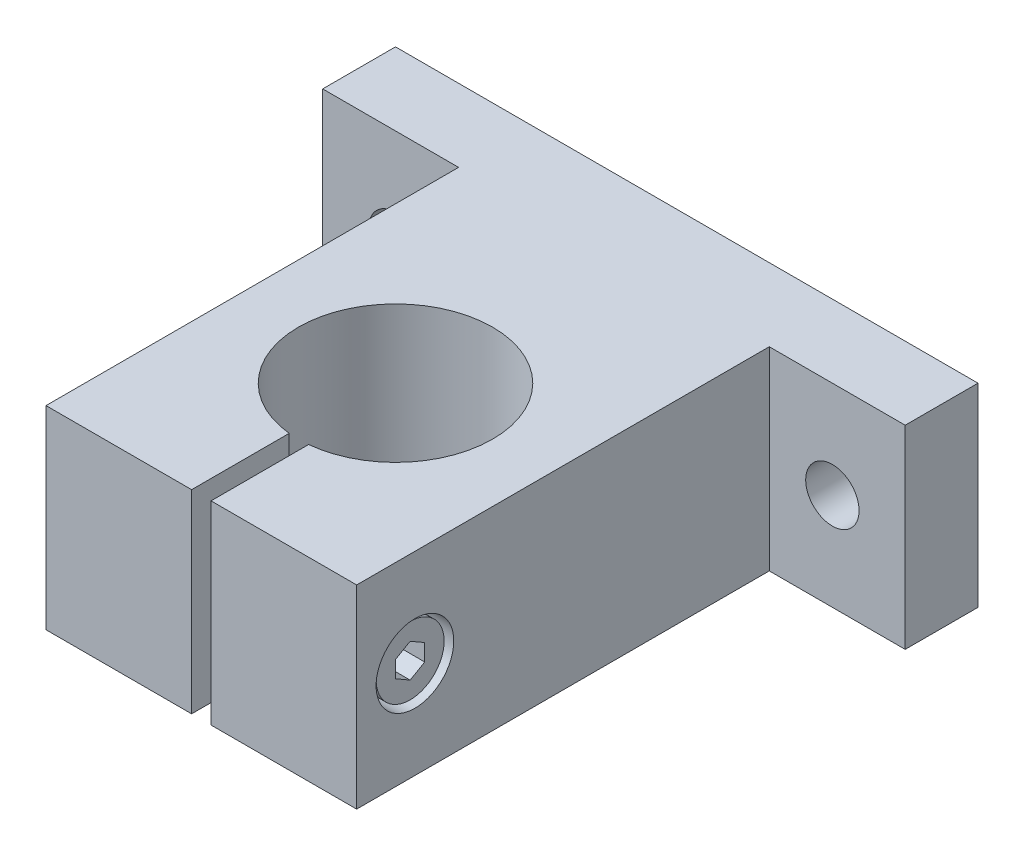
ISO-10303-21;
HEADER;
FILE_DESCRIPTION(('STEP AP214'),'2;1');
FILE_NAME('part.step','',(''),(''),'','','');
FILE_SCHEMA(('AUTOMOTIVE_DESIGN { 1 0 10303 214 1 1 1 1 }'));
ENDSEC;
DATA;
#1=APPLICATION_CONTEXT('core data for automotive mechanical design processes');
#2=APPLICATION_PROTOCOL_DEFINITION('international standard','automotive_design',2000,#1);
#3=PRODUCT_CONTEXT('',#1,'mechanical');
#4=PRODUCT('Part','Part','',(#3));
#5=PRODUCT_RELATED_PRODUCT_CATEGORY('part','',(#4));
#6=PRODUCT_DEFINITION_FORMATION('','',#4);
#7=PRODUCT_DEFINITION_CONTEXT('part definition',#1,'design');
#8=PRODUCT_DEFINITION('design','',#6,#7);
#9=PRODUCT_DEFINITION_SHAPE('','',#8);
#10=(LENGTH_UNIT() NAMED_UNIT(*) SI_UNIT(.MILLI.,.METRE.));
#11=(NAMED_UNIT(*) PLANE_ANGLE_UNIT() SI_UNIT($,.RADIAN.));
#12=(NAMED_UNIT(*) SI_UNIT($,.STERADIAN.) SOLID_ANGLE_UNIT());
#13=UNCERTAINTY_MEASURE_WITH_UNIT(LENGTH_MEASURE(1.E-05),#10,'distance_accuracy_value','');
#14=(GEOMETRIC_REPRESENTATION_CONTEXT(3) GLOBAL_UNCERTAINTY_ASSIGNED_CONTEXT((#13)) GLOBAL_UNIT_ASSIGNED_CONTEXT((#10,
#11,#12)) REPRESENTATION_CONTEXT('',''));
#15=CARTESIAN_POINT('',(0.,0.,0.));
#16=DIRECTION('',(0.,0.,1.));
#17=DIRECTION('',(1.,0.,0.));
#18=AXIS2_PLACEMENT_3D('',#15,#16,#17);
#19=CARTESIAN_POINT('',(15.51,-1.73205080756888,14.));
#20=DIRECTION('',(0.,-0.866025403784439,-0.5));
#21=DIRECTION('',(0.,0.5,-0.866025403784439));
#22=AXIS2_PLACEMENT_3D('',#19,#20,#21);
#23=PLANE('',#22);
#24=DIRECTION('',(1.,0.,0.));
#25=VECTOR('',#24,1.);
#26=CARTESIAN_POINT('',(15.51,-1.73205080756888,14.));
#27=LINE('',#26,#25);
#28=CARTESIAN_POINT('',(12.8433333333333,-1.73205080756888,14.));
#29=VERTEX_POINT('',#28);
#30=CARTESIAN_POINT('',(15.51,-1.73205080756888,14.));
#31=VERTEX_POINT('',#30);
#32=EDGE_CURVE('E422',#29,#31,#27,.T.);
#33=ORIENTED_EDGE('',*,*,#32,.T.);
#34=DIRECTION('',(0.,0.5,-0.866025403784439));
#35=VECTOR('',#34,1.);
#36=CARTESIAN_POINT('',(15.51,-1.73205080756888,14.));
#37=LINE('',#36,#35);
#38=CARTESIAN_POINT('',(15.51,-0.86602540378444,12.5));
#39=VERTEX_POINT('',#38);
#40=EDGE_CURVE('E429',#39,#31,#37,.F.);
#41=ORIENTED_EDGE('',*,*,#40,.F.);
#42=DIRECTION('',(-1.,0.,0.));
#43=VECTOR('',#42,1.);
#44=CARTESIAN_POINT('',(15.51,-0.86602540378444,12.5));
#45=LINE('',#44,#43);
#46=CARTESIAN_POINT('',(12.8433333333333,-0.866025403784439,12.5));
#47=VERTEX_POINT('',#46);
#48=EDGE_CURVE('E408',#39,#47,#45,.T.);
#49=ORIENTED_EDGE('',*,*,#48,.T.);
#50=DIRECTION('',(0.,0.5,-0.866025403784439));
#51=VECTOR('',#50,1.);
#52=CARTESIAN_POINT('',(12.8433333333333,-1.73205080756888,14.));
#53=LINE('',#52,#51);
#54=EDGE_CURVE('E426',#29,#47,#53,.T.);
#55=ORIENTED_EDGE('',*,*,#54,.F.);
#56=EDGE_LOOP('',(#33,#41,#49,#55));
#57=FACE_BOUND('',#56,.T.);
#58=ADVANCED_FACE('F16',(#57),#23,.F.);
#59=CARTESIAN_POINT('',(15.51,-0.86602540378444,15.5));
#60=DIRECTION('',(0.,-0.866025403784439,0.5));
#61=DIRECTION('',(0.,-0.5,-0.866025403784439));
#62=AXIS2_PLACEMENT_3D('',#59,#60,#61);
#63=PLANE('',#62);
#64=DIRECTION('',(1.,0.,0.));
#65=VECTOR('',#64,1.);
#66=CARTESIAN_POINT('',(15.51,-0.866025403784439,15.5));
#67=LINE('',#66,#65);
#68=CARTESIAN_POINT('',(12.8433333333333,-0.866025403784439,15.5));
#69=VERTEX_POINT('',#68);
#70=CARTESIAN_POINT('',(15.51,-0.86602540378444,15.5));
#71=VERTEX_POINT('',#70);
#72=EDGE_CURVE('E401',#69,#71,#67,.T.);
#73=ORIENTED_EDGE('',*,*,#72,.T.);
#74=DIRECTION('',(0.,-0.5,-0.866025403784439));
#75=VECTOR('',#74,1.);
#76=CARTESIAN_POINT('',(15.51,-0.86602540378444,15.5));
#77=LINE('',#76,#75);
#78=EDGE_CURVE('E419',#31,#71,#77,.F.);
#79=ORIENTED_EDGE('',*,*,#78,.F.);
#80=ORIENTED_EDGE('',*,*,#32,.F.);
#81=DIRECTION('',(0.,-0.5,-0.866025403784439));
#82=VECTOR('',#81,1.);
#83=CARTESIAN_POINT('',(12.8433333333333,-0.866025403784439,15.5));
#84=LINE('',#83,#82);
#85=EDGE_CURVE('E415',#69,#29,#84,.T.);
#86=ORIENTED_EDGE('',*,*,#85,.F.);
#87=EDGE_LOOP('',(#73,#79,#80,#86));
#88=FACE_BOUND('',#87,.T.);
#89=ADVANCED_FACE('F510',(#88),#63,.F.);
#90=CARTESIAN_POINT('',(15.51,-0.86602540378444,12.5));
#91=DIRECTION('',(0.,0.,-1.));
#92=DIRECTION('',(-1.,0.,0.));
#93=AXIS2_PLACEMENT_3D('',#90,#91,#92);
#94=PLANE('',#93);
#95=ORIENTED_EDGE('',*,*,#48,.F.);
#96=DIRECTION('',(0.,1.,0.));
#97=VECTOR('',#96,1.);
#98=CARTESIAN_POINT('',(15.51,-0.86602540378444,12.5));
#99=LINE('',#98,#97);
#100=CARTESIAN_POINT('',(15.51,0.866025403784438,12.5));
#101=VERTEX_POINT('',#100);
#102=EDGE_CURVE('E411',#101,#39,#99,.F.);
#103=ORIENTED_EDGE('',*,*,#102,.F.);
#104=DIRECTION('',(1.,0.,0.));
#105=VECTOR('',#104,1.);
#106=CARTESIAN_POINT('',(15.51,0.866025403784438,12.5));
#107=LINE('',#106,#105);
#108=CARTESIAN_POINT('',(12.8433333333333,0.866025403784438,12.5));
#109=VERTEX_POINT('',#108);
#110=EDGE_CURVE('E390',#101,#109,#107,.F.);
#111=ORIENTED_EDGE('',*,*,#110,.T.);
#112=DIRECTION('',(0.,1.,0.));
#113=VECTOR('',#112,1.);
#114=CARTESIAN_POINT('',(12.8433333333333,-0.86602540378444,12.5));
#115=LINE('',#114,#113);
#116=EDGE_CURVE('E405',#47,#109,#115,.T.);
#117=ORIENTED_EDGE('',*,*,#116,.F.);
#118=EDGE_LOOP('',(#95,#103,#111,#117));
#119=FACE_BOUND('',#118,.T.);
#120=ADVANCED_FACE('F505',(#119),#94,.F.);
#121=CARTESIAN_POINT('',(15.51,0.866025403784438,15.5));
#122=DIRECTION('',(0.,0.,1.));
#123=DIRECTION('',(0.,-1.,0.));
#124=AXIS2_PLACEMENT_3D('',#121,#122,#123);
#125=PLANE('',#124);
#126=DIRECTION('',(1.,0.,0.));
#127=VECTOR('',#126,1.);
#128=CARTESIAN_POINT('',(15.51,0.866025403784439,15.5));
#129=LINE('',#128,#127);
#130=CARTESIAN_POINT('',(12.8433333333333,0.866025403784438,15.5));
#131=VERTEX_POINT('',#130);
#132=CARTESIAN_POINT('',(15.51,0.866025403784438,15.5));
#133=VERTEX_POINT('',#132);
#134=EDGE_CURVE('E379',#131,#133,#129,.T.);
#135=ORIENTED_EDGE('',*,*,#134,.T.);
#136=DIRECTION('',(0.,-1.,0.));
#137=VECTOR('',#136,1.);
#138=CARTESIAN_POINT('',(15.51,0.866025403784438,15.5));
#139=LINE('',#138,#137);
#140=EDGE_CURVE('E398',#71,#133,#139,.F.);
#141=ORIENTED_EDGE('',*,*,#140,.F.);
#142=ORIENTED_EDGE('',*,*,#72,.F.);
#143=DIRECTION('',(0.,1.,0.));
#144=VECTOR('',#143,1.);
#145=CARTESIAN_POINT('',(12.8433333333333,0.,15.5));
#146=LINE('',#145,#144);
#147=EDGE_CURVE('E383',#131,#69,#146,.F.);
#148=ORIENTED_EDGE('',*,*,#147,.F.);
#149=EDGE_LOOP('',(#135,#141,#142,#148));
#150=FACE_BOUND('',#149,.T.);
#151=ADVANCED_FACE('F495',(#150),#125,.F.);
#152=CARTESIAN_POINT('',(15.51,0.866025403784438,12.5));
#153=DIRECTION('',(0.,0.866025403784439,-0.5));
#154=DIRECTION('',(0.,0.5,0.866025403784439));
#155=AXIS2_PLACEMENT_3D('',#152,#153,#154);
#156=PLANE('',#155);
#157=ORIENTED_EDGE('',*,*,#110,.F.);
#158=DIRECTION('',(0.,0.5,0.866025403784439));
#159=VECTOR('',#158,1.);
#160=CARTESIAN_POINT('',(15.51,0.866025403784438,12.5));
#161=LINE('',#160,#159);
#162=CARTESIAN_POINT('',(15.51,1.73205080756888,14.));
#163=VERTEX_POINT('',#162);
#164=EDGE_CURVE('E394',#163,#101,#161,.F.);
#165=ORIENTED_EDGE('',*,*,#164,.F.);
#166=DIRECTION('',(1.,0.,0.));
#167=VECTOR('',#166,1.);
#168=CARTESIAN_POINT('',(15.51,1.73205080756888,14.));
#169=LINE('',#168,#167);
#170=CARTESIAN_POINT('',(12.8433333333333,1.73205080756888,14.));
#171=VERTEX_POINT('',#170);
#172=EDGE_CURVE('E375',#163,#171,#169,.F.);
#173=ORIENTED_EDGE('',*,*,#172,.T.);
#174=DIRECTION('',(0.,0.5,0.866025403784439));
#175=VECTOR('',#174,1.);
#176=CARTESIAN_POINT('',(12.8433333333333,0.866025403784438,12.5));
#177=LINE('',#176,#175);
#178=EDGE_CURVE('E387',#109,#171,#177,.T.);
#179=ORIENTED_EDGE('',*,*,#178,.F.);
#180=EDGE_LOOP('',(#157,#165,#173,#179));
#181=FACE_BOUND('',#180,.T.);
#182=ADVANCED_FACE('F502',(#181),#156,.F.);
#183=CARTESIAN_POINT('',(12.8433333333333,0.,14.));
#184=DIRECTION('',(1.,0.,0.));
#185=DIRECTION('',(0.,1.,0.));
#186=AXIS2_PLACEMENT_3D('',#183,#184,#185);
#187=PLANE('',#186);
#188=ORIENTED_EDGE('',*,*,#54,.T.);
#189=ORIENTED_EDGE('',*,*,#116,.T.);
#190=ORIENTED_EDGE('',*,*,#178,.T.);
#191=DIRECTION('',(0.,-0.5,0.866025403784439));
#192=VECTOR('',#191,1.);
#193=CARTESIAN_POINT('',(12.8433333333333,1.73205080756888,14.));
#194=LINE('',#193,#192);
#195=EDGE_CURVE('E371',#171,#131,#194,.T.);
#196=ORIENTED_EDGE('',*,*,#195,.T.);
#197=ORIENTED_EDGE('',*,*,#147,.T.);
#198=ORIENTED_EDGE('',*,*,#85,.T.);
#199=EDGE_LOOP('',(#188,#189,#190,#196,#197,#198));
#200=FACE_BOUND('',#199,.T.);
#201=ADVANCED_FACE('F512',(#200),#187,.T.);
#202=CARTESIAN_POINT('',(15.51,1.73205080756888,14.));
#203=DIRECTION('',(0.,0.866025403784439,0.5));
#204=DIRECTION('',(0.,-0.5,0.866025403784439));
#205=AXIS2_PLACEMENT_3D('',#202,#203,#204);
#206=PLANE('',#205);
#207=ORIENTED_EDGE('',*,*,#172,.F.);
#208=DIRECTION('',(0.,0.5,-0.866025403784439));
#209=VECTOR('',#208,1.);
#210=CARTESIAN_POINT('',(15.51,0.866025403784438,15.5));
#211=LINE('',#210,#209);
#212=EDGE_CURVE('E367',#133,#163,#211,.T.);
#213=ORIENTED_EDGE('',*,*,#212,.F.);
#214=ORIENTED_EDGE('',*,*,#134,.F.);
#215=ORIENTED_EDGE('',*,*,#195,.F.);
#216=EDGE_LOOP('',(#207,#213,#214,#215));
#217=FACE_BOUND('',#216,.T.);
#218=ADVANCED_FACE('F487',(#217),#206,.F.);
#219=CARTESIAN_POINT('',(15.51,0.,15.75));
#220=DIRECTION('',(1.,0.,0.));
#221=DIRECTION('',(0.,1.,0.));
#222=AXIS2_PLACEMENT_3D('',#219,#220,#221);
#223=PLANE('',#222);
#224=CARTESIAN_POINT('',(15.51,0.,14.));
#225=DIRECTION('',(1.,0.,0.));
#226=DIRECTION('',(0.,0.,-1.));
#227=AXIS2_PLACEMENT_3D('',#224,#225,#226);
#228=CIRCLE('',#227,3.5);
#229=CARTESIAN_POINT('',(15.51,0.,10.5));
#230=VERTEX_POINT('',#229);
#231=EDGE_CURVE('E19',#230,#230,#228,.F.);
#232=ORIENTED_EDGE('',*,*,#231,.F.);
#233=EDGE_LOOP('',(#232));
#234=FACE_BOUND('',#233,.T.);
#235=ORIENTED_EDGE('',*,*,#140,.T.);
#236=ORIENTED_EDGE('',*,*,#212,.T.);
#237=ORIENTED_EDGE('',*,*,#164,.T.);
#238=ORIENTED_EDGE('',*,*,#102,.T.);
#239=ORIENTED_EDGE('',*,*,#40,.T.);
#240=ORIENTED_EDGE('',*,*,#78,.T.);
#241=EDGE_LOOP('',(#235,#236,#237,#238,#239,#240));
#242=FACE_BOUND('',#241,.T.);
#243=ADVANCED_FACE('F484',(#234,#242),#223,.T.);
#244=CARTESIAN_POINT('',(13.5105,0.,14.));
#245=DIRECTION('',(1.,0.,0.));
#246=DIRECTION('',(0.,0.,-1.));
#247=AXIS2_PLACEMENT_3D('',#244,#245,#246);
#248=CYLINDRICAL_SURFACE('',#247,3.5);
#249=ORIENTED_EDGE('',*,*,#231,.T.);
#250=EDGE_LOOP('',(#249));
#251=FACE_BOUND('',#250,.T.);
#252=CARTESIAN_POINT('',(11.511,0.,14.));
#253=DIRECTION('',(1.,0.,0.));
#254=DIRECTION('',(0.,0.,-1.));
#255=AXIS2_PLACEMENT_3D('',#252,#253,#254);
#256=CIRCLE('',#255,3.5);
#257=CARTESIAN_POINT('',(11.511,0.,10.5));
#258=VERTEX_POINT('',#257);
#259=EDGE_CURVE('E472',#258,#258,#256,.F.);
#260=ORIENTED_EDGE('',*,*,#259,.F.);
#261=EDGE_LOOP('',(#260));
#262=FACE_BOUND('',#261,.T.);
#263=ADVANCED_FACE('F481',(#251,#262),#248,.T.);
#264=CARTESIAN_POINT('',(11.511,0.,16.75));
#265=DIRECTION('',(-1.,0.,0.));
#266=DIRECTION('',(0.,0.,1.));
#267=AXIS2_PLACEMENT_3D('',#264,#265,#266);
#268=PLANE('',#267);
#269=CARTESIAN_POINT('',(11.511,0.,14.));
#270=DIRECTION('',(1.,0.,0.));
#271=DIRECTION('',(0.,0.,-1.));
#272=AXIS2_PLACEMENT_3D('',#269,#270,#271);
#273=CIRCLE('',#272,2.);
#274=CARTESIAN_POINT('',(11.511,0.,12.));
#275=VERTEX_POINT('',#274);
#276=EDGE_CURVE('E469',#275,#275,#273,.F.);
#277=ORIENTED_EDGE('',*,*,#276,.F.);
#278=EDGE_LOOP('',(#277));
#279=FACE_BOUND('',#278,.T.);
#280=ORIENTED_EDGE('',*,*,#259,.T.);
#281=EDGE_LOOP('',(#280));
#282=FACE_BOUND('',#281,.T.);
#283=ADVANCED_FACE('F629',(#279,#282),#268,.T.);
#284=CARTESIAN_POINT('',(-12.002,0.,14.8));
#285=DIRECTION('',(1.,0.,0.));
#286=DIRECTION('',(0.,1.,0.));
#287=AXIS2_PLACEMENT_3D('',#284,#285,#286);
#288=PLANE('',#287);
#289=CARTESIAN_POINT('',(-12.002,0.,14.));
#290=DIRECTION('',(1.,0.,0.));
#291=DIRECTION('',(0.,0.,-1.));
#292=AXIS2_PLACEMENT_3D('',#289,#290,#291);
#293=CIRCLE('',#292,1.6);
#294=CARTESIAN_POINT('',(-12.002,0.,12.4));
#295=VERTEX_POINT('',#294);
#296=EDGE_CURVE('E465',#295,#295,#293,.F.);
#297=ORIENTED_EDGE('',*,*,#296,.T.);
#298=EDGE_LOOP('',(#297));
#299=FACE_BOUND('',#298,.T.);
#300=ADVANCED_FACE('F625',(#299),#288,.F.);
#301=CARTESIAN_POINT('',(-0.2395,0.,14.));
#302=DIRECTION('',(1.,0.,0.));
#303=DIRECTION('',(0.,0.,-1.));
#304=AXIS2_PLACEMENT_3D('',#301,#302,#303);
#305=CYLINDRICAL_SURFACE('',#304,2.);
#306=CARTESIAN_POINT('',(11.501,0.,14.));
#307=DIRECTION('',(1.,0.,0.));
#308=DIRECTION('',(0.,0.,-1.));
#309=AXIS2_PLACEMENT_3D('',#306,#307,#308);
#310=CIRCLE('',#309,2.);
#311=CARTESIAN_POINT('',(11.501,0.,12.));
#312=VERTEX_POINT('',#311);
#313=EDGE_CURVE('E366',#312,#312,#310,.T.);
#314=ORIENTED_EDGE('',*,*,#313,.T.);
#315=EDGE_LOOP('',(#314));
#316=FACE_BOUND('',#315,.T.);
#317=ORIENTED_EDGE('',*,*,#276,.T.);
#318=EDGE_LOOP('',(#317));
#319=FACE_BOUND('',#318,.T.);
#320=ADVANCED_FACE('F621',(#316,#319),#305,.T.);
#321=CARTESIAN_POINT('',(-13.8015,0.,14.));
#322=DIRECTION('',(1.,0.,0.));
#323=DIRECTION('',(0.,0.,-1.));
#324=AXIS2_PLACEMENT_3D('',#321,#322,#323);
#325=CYLINDRICAL_SURFACE('',#324,1.6);
#326=ORIENTED_EDGE('',*,*,#296,.F.);
#327=EDGE_LOOP('',(#326));
#328=FACE_BOUND('',#327,.T.);
#329=CARTESIAN_POINT('',(-15.6010000000038,0.,14.));
#330=DIRECTION('',(-1.,0.,0.));
#331=DIRECTION('',(0.,0.,1.));
#332=AXIS2_PLACEMENT_3D('',#329,#330,#331);
#333=CIRCLE('',#332,1.60000000000628);
#334=CARTESIAN_POINT('',(-15.6010000000038,0.,15.6000000000063));
#335=VERTEX_POINT('',#334);
#336=EDGE_CURVE('E362',#335,#335,#333,.T.);
#337=ORIENTED_EDGE('',*,*,#336,.T.);
#338=EDGE_LOOP('',(#337));
#339=FACE_BOUND('',#338,.T.);
#340=ADVANCED_FACE('F617',(#328,#339),#325,.F.);
#341=CARTESIAN_POINT('',(11.501,0.,16.));
#342=DIRECTION('',(-1.,0.,0.));
#343=DIRECTION('',(0.,0.,1.));
#344=AXIS2_PLACEMENT_3D('',#341,#342,#343);
#345=PLANE('',#344);
#346=CARTESIAN_POINT('',(11.501,0.,14.));
#347=DIRECTION('',(1.,0.,0.));
#348=DIRECTION('',(0.,0.,-1.));
#349=AXIS2_PLACEMENT_3D('',#346,#347,#348);
#350=CIRCLE('',#349,4.);
#351=CARTESIAN_POINT('',(11.501,0.,10.));
#352=VERTEX_POINT('',#351);
#353=EDGE_CURVE('E329',#352,#352,#350,.T.);
#354=ORIENTED_EDGE('',*,*,#353,.T.);
#355=EDGE_LOOP('',(#354));
#356=FACE_BOUND('',#355,.T.);
#357=ORIENTED_EDGE('',*,*,#313,.F.);
#358=EDGE_LOOP('',(#357));
#359=FACE_BOUND('',#358,.T.);
#360=ADVANCED_FACE('F613',(#356,#359),#345,.F.);
#361=CARTESIAN_POINT('',(-11.,5.,-16.));
#362=DIRECTION('',(0.,0.,1.));
#363=DIRECTION('',(0.,-1.,0.));
#364=AXIS2_PLACEMENT_3D('',#361,#362,#363);
#365=PLANE('',#364);
#366=DIRECTION('',(0.,1.,0.));
#367=VECTOR('',#366,1.);
#368=CARTESIAN_POINT('',(-11.,5.,-16.));
#369=LINE('',#368,#367);
#370=CARTESIAN_POINT('',(-11.,-5.,-16.));
#371=VERTEX_POINT('',#370);
#372=CARTESIAN_POINT('',(-11.,5.,-16.));
#373=VERTEX_POINT('',#372);
#374=EDGE_CURVE('E313',#371,#373,#369,.T.);
#375=ORIENTED_EDGE('',*,*,#374,.T.);
#376=DIRECTION('',(1.,0.,0.));
#377=VECTOR('',#376,1.);
#378=CARTESIAN_POINT('',(0.,5.,-16.));
#379=LINE('',#378,#377);
#380=CARTESIAN_POINT('',(11.,5.,-16.));
#381=VERTEX_POINT('',#380);
#382=EDGE_CURVE('E321',#373,#381,#379,.T.);
#383=ORIENTED_EDGE('',*,*,#382,.T.);
#384=DIRECTION('',(0.,1.,0.));
#385=VECTOR('',#384,1.);
#386=CARTESIAN_POINT('',(11.,5.,-16.));
#387=LINE('',#386,#385);
#388=CARTESIAN_POINT('',(11.,-5.,-16.));
#389=VERTEX_POINT('',#388);
#390=EDGE_CURVE('E325',#381,#389,#387,.F.);
#391=ORIENTED_EDGE('',*,*,#390,.T.);
#392=DIRECTION('',(1.,0.,0.));
#393=VECTOR('',#392,1.);
#394=CARTESIAN_POINT('',(0.,-5.,-16.));
#395=LINE('',#394,#393);
#396=EDGE_CURVE('E302',#371,#389,#395,.T.);
#397=ORIENTED_EDGE('',*,*,#396,.F.);
#398=EDGE_LOOP('',(#375,#383,#391,#397));
#399=FACE_BOUND('',#398,.T.);
#400=ADVANCED_FACE('F609',(#399),#365,.F.);
#401=CARTESIAN_POINT('',(-16.0000000000196,0.,14.));
#402=DIRECTION('',(-1.,0.,0.));
#403=DIRECTION('',(0.,0.,1.));
#404=AXIS2_PLACEMENT_3D('',#401,#402,#403);
#405=CONICAL_SURFACE('',#404,1.99900000002208,0.785398163326216);
#406=ORIENTED_EDGE('',*,*,#336,.F.);
#407=EDGE_LOOP('',(#406));
#408=FACE_BOUND('',#407,.T.);
#409=CARTESIAN_POINT('',(-16.0000000000764,0.,14.));
#410=DIRECTION('',(-1.,0.,0.));
#411=DIRECTION('',(0.,0.,1.));
#412=AXIS2_PLACEMENT_3D('',#409,#410,#411);
#413=CIRCLE('',#412,1.99900000007893);
#414=CARTESIAN_POINT('',(-16.0000000000764,0.,15.9990000000789));
#415=VERTEX_POINT('',#414);
#416=EDGE_CURVE('E291',#415,#415,#413,.F.);
#417=ORIENTED_EDGE('',*,*,#416,.F.);
#418=EDGE_LOOP('',(#417));
#419=FACE_BOUND('',#418,.T.);
#420=ADVANCED_FACE('F605',(#408,#419),#405,.F.);
#421=CARTESIAN_POINT('',(-0.2395,0.,14.));
#422=DIRECTION('',(1.,0.,0.));
#423=DIRECTION('',(0.,0.,-1.));
#424=AXIS2_PLACEMENT_3D('',#421,#422,#423);
#425=CYLINDRICAL_SURFACE('',#424,2.);
#426=CARTESIAN_POINT('',(-1.,0.,14.));
#427=DIRECTION('',(1.,0.,0.));
#428=DIRECTION('',(0.,0.,-1.));
#429=AXIS2_PLACEMENT_3D('',#426,#427,#428);
#430=CIRCLE('',#429,2.);
#431=CARTESIAN_POINT('',(-1.,0.,12.));
#432=VERTEX_POINT('',#431);
#433=EDGE_CURVE('E225',#432,#432,#430,.F.);
#434=ORIENTED_EDGE('',*,*,#433,.F.);
#435=EDGE_LOOP('',(#434));
#436=FACE_BOUND('',#435,.T.);
#437=CARTESIAN_POINT('',(1.,0.,14.));
#438=DIRECTION('',(1.,0.,0.));
#439=DIRECTION('',(0.,0.,-1.));
#440=AXIS2_PLACEMENT_3D('',#437,#438,#439);
#441=CIRCLE('',#440,2.);
#442=CARTESIAN_POINT('',(1.,0.,12.));
#443=VERTEX_POINT('',#442);
#444=EDGE_CURVE('E233',#443,#443,#441,.T.);
#445=ORIENTED_EDGE('',*,*,#444,.F.);
#446=EDGE_LOOP('',(#445));
#447=FACE_BOUND('',#446,.T.);
#448=ADVANCED_FACE('F601',(#436,#447),#425,.T.);
#449=CARTESIAN_POINT('',(13.751,0.,14.));
#450=DIRECTION('',(1.,0.,0.));
#451=DIRECTION('',(0.,0.,-1.));
#452=AXIS2_PLACEMENT_3D('',#449,#450,#451);
#453=CYLINDRICAL_SURFACE('',#452,4.);
#454=ORIENTED_EDGE('',*,*,#353,.F.);
#455=EDGE_LOOP('',(#454));
#456=FACE_BOUND('',#455,.T.);
#457=CARTESIAN_POINT('',(16.,0.,14.));
#458=DIRECTION('',(1.,0.,0.));
#459=DIRECTION('',(0.,0.,-1.));
#460=AXIS2_PLACEMENT_3D('',#457,#458,#459);
#461=CIRCLE('',#460,4.);
#462=CARTESIAN_POINT('',(16.,0.,10.));
#463=VERTEX_POINT('',#462);
#464=EDGE_CURVE('E344',#463,#463,#461,.F.);
#465=ORIENTED_EDGE('',*,*,#464,.F.);
#466=EDGE_LOOP('',(#465));
#467=FACE_BOUND('',#466,.T.);
#468=ADVANCED_FACE('F597',(#456,#467),#453,.F.);
#469=CARTESIAN_POINT('',(-22.5,0.,0.));
#470=DIRECTION('',(0.,0.,-1.));
#471=DIRECTION('',(-1.,0.,0.));
#472=AXIS2_PLACEMENT_3D('',#469,#470,#471);
#473=CYLINDRICAL_SURFACE('',#472,2.75);
#474=CARTESIAN_POINT('',(-22.5,0.,-22.5));
#475=DIRECTION('',(0.,0.,-1.));
#476=DIRECTION('',(-1.,0.,0.));
#477=AXIS2_PLACEMENT_3D('',#474,#475,#476);
#478=CIRCLE('',#477,2.75);
#479=CARTESIAN_POINT('',(-25.25,0.,-22.5));
#480=VERTEX_POINT('',#479);
#481=EDGE_CURVE('E292',#480,#480,#478,.T.);
#482=ORIENTED_EDGE('',*,*,#481,.F.);
#483=EDGE_LOOP('',(#482));
#484=FACE_BOUND('',#483,.T.);
#485=CARTESIAN_POINT('',(-22.5,0.,-30.));
#486=DIRECTION('',(0.,0.,-1.));
#487=DIRECTION('',(-1.,0.,0.));
#488=AXIS2_PLACEMENT_3D('',#485,#486,#487);
#489=CIRCLE('',#488,2.75);
#490=CARTESIAN_POINT('',(-25.25,0.,-30.));
#491=VERTEX_POINT('',#490);
#492=EDGE_CURVE('E439',#491,#491,#489,.F.);
#493=ORIENTED_EDGE('',*,*,#492,.F.);
#494=EDGE_LOOP('',(#493));
#495=FACE_BOUND('',#494,.T.);
#496=ADVANCED_FACE('F593',(#484,#495),#473,.F.);
#497=CARTESIAN_POINT('',(22.5,0.,0.));
#498=DIRECTION('',(0.,0.,-1.));
#499=DIRECTION('',(-1.,0.,0.));
#500=AXIS2_PLACEMENT_3D('',#497,#498,#499);
#501=CYLINDRICAL_SURFACE('',#500,2.75);
#502=CARTESIAN_POINT('',(22.5,0.,-22.5));
#503=DIRECTION('',(0.,0.,-1.));
#504=DIRECTION('',(-1.,0.,0.));
#505=AXIS2_PLACEMENT_3D('',#502,#503,#504);
#506=CIRCLE('',#505,2.75);
#507=CARTESIAN_POINT('',(19.75,0.,-22.5));
#508=VERTEX_POINT('',#507);
#509=EDGE_CURVE('E349',#508,#508,#506,.T.);
#510=ORIENTED_EDGE('',*,*,#509,.F.);
#511=EDGE_LOOP('',(#510));
#512=FACE_BOUND('',#511,.T.);
#513=CARTESIAN_POINT('',(22.5,0.,-30.));
#514=DIRECTION('',(0.,0.,-1.));
#515=DIRECTION('',(-1.,0.,0.));
#516=AXIS2_PLACEMENT_3D('',#513,#514,#515);
#517=CIRCLE('',#516,2.75);
#518=CARTESIAN_POINT('',(19.75,0.,-30.));
#519=VERTEX_POINT('',#518);
#520=EDGE_CURVE('E435',#519,#519,#517,.F.);
#521=ORIENTED_EDGE('',*,*,#520,.F.);
#522=EDGE_LOOP('',(#521));
#523=FACE_BOUND('',#522,.T.);
#524=ADVANCED_FACE('F589',(#512,#523),#501,.F.);
#525=CARTESIAN_POINT('',(11.,5.,-16.));
#526=DIRECTION('',(1.,0.,0.));
#527=DIRECTION('',(0.,1.,0.));
#528=AXIS2_PLACEMENT_3D('',#525,#526,#527);
#529=PLANE('',#528);
#530=DIRECTION('',(0.,0.,1.));
#531=VECTOR('',#530,1.);
#532=CARTESIAN_POINT('',(11.,-5.,0.));
#533=LINE('',#532,#531);
#534=CARTESIAN_POINT('',(11.,-5.,-30.));
#535=VERTEX_POINT('',#534);
#536=EDGE_CURVE('E299',#389,#535,#533,.F.);
#537=ORIENTED_EDGE('',*,*,#536,.F.);
#538=ORIENTED_EDGE('',*,*,#390,.F.);
#539=DIRECTION('',(0.,0.,1.));
#540=VECTOR('',#539,1.);
#541=CARTESIAN_POINT('',(11.,5.,0.));
#542=LINE('',#541,#540);
#543=CARTESIAN_POINT('',(11.,5.,-30.));
#544=VERTEX_POINT('',#543);
#545=EDGE_CURVE('E317',#381,#544,#542,.F.);
#546=ORIENTED_EDGE('',*,*,#545,.T.);
#547=DIRECTION('',(0.,1.,0.));
#548=VECTOR('',#547,1.);
#549=CARTESIAN_POINT('',(11.,10.,-30.));
#550=LINE('',#549,#548);
#551=EDGE_CURVE('E438',#535,#544,#550,.T.);
#552=ORIENTED_EDGE('',*,*,#551,.F.);
#553=EDGE_LOOP('',(#537,#538,#546,#552));
#554=FACE_BOUND('',#553,.T.);
#555=ADVANCED_FACE('F585',(#554),#529,.F.);
#556=CARTESIAN_POINT('',(0.,5.,0.));
#557=DIRECTION('',(0.,1.,0.));
#558=DIRECTION('',(0.,0.,1.));
#559=AXIS2_PLACEMENT_3D('',#556,#557,#558);
#560=PLANE('',#559);
#561=ORIENTED_EDGE('',*,*,#545,.F.);
#562=ORIENTED_EDGE('',*,*,#382,.F.);
#563=DIRECTION('',(0.,0.,1.));
#564=VECTOR('',#563,1.);
#565=CARTESIAN_POINT('',(-11.,5.,-30.01));
#566=LINE('',#565,#564);
#567=CARTESIAN_POINT('',(-11.,5.,-30.));
#568=VERTEX_POINT('',#567);
#569=EDGE_CURVE('E309',#373,#568,#566,.F.);
#570=ORIENTED_EDGE('',*,*,#569,.T.);
#571=DIRECTION('',(-1.,0.,0.));
#572=VECTOR('',#571,1.);
#573=CARTESIAN_POINT('',(30.,5.,-30.));
#574=LINE('',#573,#572);
#575=EDGE_CURVE('E1012',#544,#568,#574,.T.);
#576=ORIENTED_EDGE('',*,*,#575,.F.);
#577=EDGE_LOOP('',(#561,#562,#570,#576));
#578=FACE_BOUND('',#577,.T.);
#579=ADVANCED_FACE('F581',(#578),#560,.F.);
#580=CARTESIAN_POINT('',(-11.,5.,-30.01));
#581=DIRECTION('',(-1.,0.,0.));
#582=DIRECTION('',(0.,0.,1.));
#583=AXIS2_PLACEMENT_3D('',#580,#581,#582);
#584=PLANE('',#583);
#585=ORIENTED_EDGE('',*,*,#569,.F.);
#586=ORIENTED_EDGE('',*,*,#374,.F.);
#587=DIRECTION('',(0.,0.,1.));
#588=VECTOR('',#587,1.);
#589=CARTESIAN_POINT('',(-11.,-5.,0.));
#590=LINE('',#589,#588);
#591=CARTESIAN_POINT('',(-11.,-5.,-30.));
#592=VERTEX_POINT('',#591);
#593=EDGE_CURVE('E305',#592,#371,#590,.T.);
#594=ORIENTED_EDGE('',*,*,#593,.F.);
#595=DIRECTION('',(0.,1.,0.));
#596=VECTOR('',#595,1.);
#597=CARTESIAN_POINT('',(-11.,10.,-30.));
#598=LINE('',#597,#596);
#599=EDGE_CURVE('E1007',#568,#592,#598,.F.);
#600=ORIENTED_EDGE('',*,*,#599,.F.);
#601=EDGE_LOOP('',(#585,#586,#594,#600));
#602=FACE_BOUND('',#601,.T.);
#603=ADVANCED_FACE('F577',(#602),#584,.F.);
#604=CARTESIAN_POINT('',(0.,-5.,0.));
#605=DIRECTION('',(0.,1.,0.));
#606=DIRECTION('',(0.,0.,1.));
#607=AXIS2_PLACEMENT_3D('',#604,#605,#606);
#608=PLANE('',#607);
#609=ORIENTED_EDGE('',*,*,#396,.T.);
#610=ORIENTED_EDGE('',*,*,#536,.T.);
#611=DIRECTION('',(-1.,0.,0.));
#612=VECTOR('',#611,1.);
#613=CARTESIAN_POINT('',(30.,-5.,-30.));
#614=LINE('',#613,#612);
#615=EDGE_CURVE('E1001',#592,#535,#614,.F.);
#616=ORIENTED_EDGE('',*,*,#615,.F.);
#617=ORIENTED_EDGE('',*,*,#593,.T.);
#618=EDGE_LOOP('',(#609,#610,#616,#617));
#619=FACE_BOUND('',#618,.T.);
#620=ADVANCED_FACE('F574',(#619),#608,.T.);
#621=CARTESIAN_POINT('',(0.,10.,0.));
#622=DIRECTION('',(0.,1.,0.));
#623=DIRECTION('',(0.,0.,1.));
#624=AXIS2_PLACEMENT_3D('',#621,#622,#623);
#625=PLANE('',#624);
#626=DIRECTION('',(1.,0.,0.));
#627=VECTOR('',#626,1.);
#628=CARTESIAN_POINT('',(16.,10.,-22.5));
#629=LINE('',#628,#627);
#630=CARTESIAN_POINT('',(30.,10.,-22.5));
#631=VERTEX_POINT('',#630);
#632=CARTESIAN_POINT('',(16.,10.,-22.5));
#633=VERTEX_POINT('',#632);
#634=EDGE_CURVE('E446',#631,#633,#629,.F.);
#635=ORIENTED_EDGE('',*,*,#634,.F.);
#636=DIRECTION('',(0.,0.,1.));
#637=VECTOR('',#636,1.);
#638=CARTESIAN_POINT('',(30.,10.,-22.5));
#639=LINE('',#638,#637);
#640=CARTESIAN_POINT('',(30.,10.,-30.));
#641=VERTEX_POINT('',#640);
#642=EDGE_CURVE('E1020',#641,#631,#639,.T.);
#643=ORIENTED_EDGE('',*,*,#642,.F.);
#644=DIRECTION('',(-1.,0.,0.));
#645=VECTOR('',#644,1.);
#646=CARTESIAN_POINT('',(30.,10.,-30.));
#647=LINE('',#646,#645);
#648=CARTESIAN_POINT('',(-30.,10.,-30.));
#649=VERTEX_POINT('',#648);
#650=EDGE_CURVE('E1006',#649,#641,#647,.F.);
#651=ORIENTED_EDGE('',*,*,#650,.F.);
#652=DIRECTION('',(0.,0.,1.));
#653=VECTOR('',#652,1.);
#654=CARTESIAN_POINT('',(-30.,10.,-30.));
#655=LINE('',#654,#653);
#656=CARTESIAN_POINT('',(-30.,10.,-22.5));
#657=VERTEX_POINT('',#656);
#658=EDGE_CURVE('E282',#657,#649,#655,.F.);
#659=ORIENTED_EDGE('',*,*,#658,.F.);
#660=DIRECTION('',(1.,0.,0.));
#661=VECTOR('',#660,1.);
#662=CARTESIAN_POINT('',(-30.,10.,-22.5));
#663=LINE('',#662,#661);
#664=CARTESIAN_POINT('',(-16.,10.,-22.5));
#665=VERTEX_POINT('',#664);
#666=EDGE_CURVE('E288',#665,#657,#663,.F.);
#667=ORIENTED_EDGE('',*,*,#666,.F.);
#668=DIRECTION('',(0.,0.,1.));
#669=VECTOR('',#668,1.);
#670=CARTESIAN_POINT('',(-16.,10.,-22.5));
#671=LINE('',#670,#669);
#672=CARTESIAN_POINT('',(-16.,10.,20.));
#673=VERTEX_POINT('',#672);
#674=EDGE_CURVE('E270',#673,#665,#671,.F.);
#675=ORIENTED_EDGE('',*,*,#674,.F.);
#676=DIRECTION('',(1.,0.,0.));
#677=VECTOR('',#676,1.);
#678=CARTESIAN_POINT('',(-16.,10.,20.));
#679=LINE('',#678,#677);
#680=CARTESIAN_POINT('',(-1.,10.,20.));
#681=VERTEX_POINT('',#680);
#682=EDGE_CURVE('E221',#681,#673,#679,.F.);
#683=ORIENTED_EDGE('',*,*,#682,.F.);
#684=DIRECTION('',(0.,0.,1.));
#685=VECTOR('',#684,1.);
#686=CARTESIAN_POINT('',(-1.,10.,20.));
#687=LINE('',#686,#685);
#688=CARTESIAN_POINT('',(-1.,10.,9.9498743710662));
#689=VERTEX_POINT('',#688);
#690=EDGE_CURVE('E217',#689,#681,#687,.T.);
#691=ORIENTED_EDGE('',*,*,#690,.F.);
#692=CARTESIAN_POINT('',(0.,10.,0.));
#693=DIRECTION('',(0.,-1.,0.));
#694=DIRECTION('',(1.,0.,0.));
#695=AXIS2_PLACEMENT_3D('',#692,#693,#694);
#696=CIRCLE('',#695,10.);
#697=CARTESIAN_POINT('',(1.,10.,9.9498743710662));
#698=VERTEX_POINT('',#697);
#699=EDGE_CURVE('E204',#698,#689,#696,.F.);
#700=ORIENTED_EDGE('',*,*,#699,.F.);
#701=DIRECTION('',(0.,0.,1.));
#702=VECTOR('',#701,1.);
#703=CARTESIAN_POINT('',(1.,10.,9.9498743710662));
#704=LINE('',#703,#702);
#705=CARTESIAN_POINT('',(1.,10.,20.));
#706=VERTEX_POINT('',#705);
#707=EDGE_CURVE('E199',#706,#698,#704,.F.);
#708=ORIENTED_EDGE('',*,*,#707,.F.);
#709=DIRECTION('',(1.,0.,0.));
#710=VECTOR('',#709,1.);
#711=CARTESIAN_POINT('',(0.999999999999999,10.,20.));
#712=LINE('',#711,#710);
#713=CARTESIAN_POINT('',(16.,10.,20.));
#714=VERTEX_POINT('',#713);
#715=EDGE_CURVE('E334',#714,#706,#712,.F.);
#716=ORIENTED_EDGE('',*,*,#715,.F.);
#717=DIRECTION('',(0.,0.,1.));
#718=VECTOR('',#717,1.);
#719=CARTESIAN_POINT('',(16.,10.,20.));
#720=LINE('',#719,#718);
#721=EDGE_CURVE('E340',#633,#714,#720,.T.);
#722=ORIENTED_EDGE('',*,*,#721,.F.);
#723=EDGE_LOOP('',(#635,#643,#651,#659,#667,#675,#683,#691,#700,#708,#716,#722));
#724=FACE_BOUND('',#723,.T.);
#725=ADVANCED_FACE('F219',(#724),#625,.T.);
#726=CARTESIAN_POINT('',(-30.,10.,-22.5));
#727=DIRECTION('',(0.,0.,1.));
#728=DIRECTION('',(0.,-1.,0.));
#729=AXIS2_PLACEMENT_3D('',#726,#727,#728);
#730=PLANE('',#729);
#731=ORIENTED_EDGE('',*,*,#666,.T.);
#732=DIRECTION('',(0.,1.,0.));
#733=VECTOR('',#732,1.);
#734=CARTESIAN_POINT('',(-30.,10.,-22.5));
#735=LINE('',#734,#733);
#736=CARTESIAN_POINT('',(-30.,-10.,-22.5));
#737=VERTEX_POINT('',#736);
#738=EDGE_CURVE('E278',#737,#657,#735,.T.);
#739=ORIENTED_EDGE('',*,*,#738,.F.);
#740=DIRECTION('',(1.,0.,0.));
#741=VECTOR('',#740,1.);
#742=CARTESIAN_POINT('',(0.,-10.,-22.5));
#743=LINE('',#742,#741);
#744=CARTESIAN_POINT('',(-16.,-10.,-22.5));
#745=VERTEX_POINT('',#744);
#746=EDGE_CURVE('E264',#737,#745,#743,.T.);
#747=ORIENTED_EDGE('',*,*,#746,.T.);
#748=DIRECTION('',(0.,1.,0.));
#749=VECTOR('',#748,1.);
#750=CARTESIAN_POINT('',(-16.,10.,-22.5));
#751=LINE('',#750,#749);
#752=EDGE_CURVE('E267',#665,#745,#751,.F.);
#753=ORIENTED_EDGE('',*,*,#752,.F.);
#754=EDGE_LOOP('',(#731,#739,#747,#753));
#755=FACE_BOUND('',#754,.T.);
#756=ORIENTED_EDGE('',*,*,#481,.T.);
#757=EDGE_LOOP('',(#756));
#758=FACE_BOUND('',#757,.T.);
#759=ADVANCED_FACE('F567',(#755,#758),#730,.T.);
#760=CARTESIAN_POINT('',(-16.,10.,-22.5));
#761=DIRECTION('',(-1.,0.,0.));
#762=DIRECTION('',(0.,0.,1.));
#763=AXIS2_PLACEMENT_3D('',#760,#761,#762);
#764=PLANE('',#763);
#765=ORIENTED_EDGE('',*,*,#674,.T.);
#766=ORIENTED_EDGE('',*,*,#752,.T.);
#767=DIRECTION('',(0.,0.,1.));
#768=VECTOR('',#767,1.);
#769=CARTESIAN_POINT('',(-16.,-10.,0.));
#770=LINE('',#769,#768);
#771=CARTESIAN_POINT('',(-16.,-10.,20.));
#772=VERTEX_POINT('',#771);
#773=EDGE_CURVE('E253',#745,#772,#770,.T.);
#774=ORIENTED_EDGE('',*,*,#773,.T.);
#775=DIRECTION('',(0.,-1.,0.));
#776=VECTOR('',#775,1.);
#777=CARTESIAN_POINT('',(-16.,10.,20.));
#778=LINE('',#777,#776);
#779=EDGE_CURVE('E256',#673,#772,#778,.T.);
#780=ORIENTED_EDGE('',*,*,#779,.F.);
#781=EDGE_LOOP('',(#765,#766,#774,#780));
#782=FACE_BOUND('',#781,.T.);
#783=ORIENTED_EDGE('',*,*,#416,.T.);
#784=EDGE_LOOP('',(#783));
#785=FACE_BOUND('',#784,.T.);
#786=ADVANCED_FACE('F563',(#782,#785),#764,.T.);
#787=CARTESIAN_POINT('',(-16.,10.,20.));
#788=DIRECTION('',(0.,0.,1.));
#789=DIRECTION('',(0.,-1.,0.));
#790=AXIS2_PLACEMENT_3D('',#787,#788,#789);
#791=PLANE('',#790);
#792=ORIENTED_EDGE('',*,*,#682,.T.);
#793=ORIENTED_EDGE('',*,*,#779,.T.);
#794=DIRECTION('',(1.,0.,0.));
#795=VECTOR('',#794,1.);
#796=CARTESIAN_POINT('',(0.,-10.,20.));
#797=LINE('',#796,#795);
#798=CARTESIAN_POINT('',(-1.,-10.,20.));
#799=VERTEX_POINT('',#798);
#800=EDGE_CURVE('E249',#772,#799,#797,.T.);
#801=ORIENTED_EDGE('',*,*,#800,.T.);
#802=DIRECTION('',(0.,1.,0.));
#803=VECTOR('',#802,1.);
#804=CARTESIAN_POINT('',(-1.,10.,20.));
#805=LINE('',#804,#803);
#806=EDGE_CURVE('E214',#681,#799,#805,.F.);
#807=ORIENTED_EDGE('',*,*,#806,.F.);
#808=EDGE_LOOP('',(#792,#793,#801,#807));
#809=FACE_BOUND('',#808,.T.);
#810=ADVANCED_FACE('F560',(#809),#791,.T.);
#811=CARTESIAN_POINT('',(-1.,10.,20.));
#812=DIRECTION('',(1.,0.,0.));
#813=DIRECTION('',(0.,1.,0.));
#814=AXIS2_PLACEMENT_3D('',#811,#812,#813);
#815=PLANE('',#814);
#816=ORIENTED_EDGE('',*,*,#690,.T.);
#817=ORIENTED_EDGE('',*,*,#806,.T.);
#818=DIRECTION('',(0.,0.,1.));
#819=VECTOR('',#818,1.);
#820=CARTESIAN_POINT('',(-1.,-10.,0.));
#821=LINE('',#820,#819);
#822=CARTESIAN_POINT('',(-1.,-10.,9.9498743710662));
#823=VERTEX_POINT('',#822);
#824=EDGE_CURVE('E231',#799,#823,#821,.F.);
#825=ORIENTED_EDGE('',*,*,#824,.T.);
#826=DIRECTION('',(0.,-1.,0.));
#827=VECTOR('',#826,1.);
#828=CARTESIAN_POINT('',(-1.,10.,9.9498743710662));
#829=LINE('',#828,#827);
#830=EDGE_CURVE('E209',#689,#823,#829,.T.);
#831=ORIENTED_EDGE('',*,*,#830,.F.);
#832=EDGE_LOOP('',(#816,#817,#825,#831));
#833=FACE_BOUND('',#832,.T.);
#834=ORIENTED_EDGE('',*,*,#433,.T.);
#835=EDGE_LOOP('',(#834));
#836=FACE_BOUND('',#835,.T.);
#837=ADVANCED_FACE('F228',(#833,#836),#815,.T.);
#838=CARTESIAN_POINT('',(0.,10.,0.));
#839=DIRECTION('',(0.,-1.,0.));
#840=DIRECTION('',(1.,0.,0.));
#841=AXIS2_PLACEMENT_3D('',#838,#839,#840);
#842=CYLINDRICAL_SURFACE('',#841,10.);
#843=ORIENTED_EDGE('',*,*,#699,.T.);
#844=ORIENTED_EDGE('',*,*,#830,.T.);
#845=CARTESIAN_POINT('',(0.,-10.,0.));
#846=DIRECTION('',(0.,-1.,0.));
#847=DIRECTION('',(1.,0.,0.));
#848=AXIS2_PLACEMENT_3D('',#845,#846,#847);
#849=CIRCLE('',#848,10.);
#850=CARTESIAN_POINT('',(1.,-10.,9.9498743710662));
#851=VERTEX_POINT('',#850);
#852=EDGE_CURVE('E431',#823,#851,#849,.T.);
#853=ORIENTED_EDGE('',*,*,#852,.T.);
#854=DIRECTION('',(0.,1.,0.));
#855=VECTOR('',#854,1.);
#856=CARTESIAN_POINT('',(1.,10.,9.9498743710662));
#857=LINE('',#856,#855);
#858=EDGE_CURVE('E211',#698,#851,#857,.F.);
#859=ORIENTED_EDGE('',*,*,#858,.F.);
#860=EDGE_LOOP('',(#843,#844,#853,#859));
#861=FACE_BOUND('',#860,.T.);
#862=ADVANCED_FACE('F206',(#861),#842,.F.);
#863=CARTESIAN_POINT('',(1.,10.,9.9498743710662));
#864=DIRECTION('',(-1.,0.,0.));
#865=DIRECTION('',(0.,0.,1.));
#866=AXIS2_PLACEMENT_3D('',#863,#864,#865);
#867=PLANE('',#866);
#868=ORIENTED_EDGE('',*,*,#707,.T.);
#869=ORIENTED_EDGE('',*,*,#858,.T.);
#870=DIRECTION('',(0.,0.,1.));
#871=VECTOR('',#870,1.);
#872=CARTESIAN_POINT('',(1.,-10.,0.));
#873=LINE('',#872,#871);
#874=CARTESIAN_POINT('',(1.,-10.,20.));
#875=VERTEX_POINT('',#874);
#876=EDGE_CURVE('E434',#851,#875,#873,.T.);
#877=ORIENTED_EDGE('',*,*,#876,.T.);
#878=DIRECTION('',(0.,-1.,0.));
#879=VECTOR('',#878,1.);
#880=CARTESIAN_POINT('',(0.999999999999999,10.,20.));
#881=LINE('',#880,#879);
#882=EDGE_CURVE('E337',#706,#875,#881,.T.);
#883=ORIENTED_EDGE('',*,*,#882,.F.);
#884=EDGE_LOOP('',(#868,#869,#877,#883));
#885=FACE_BOUND('',#884,.T.);
#886=ORIENTED_EDGE('',*,*,#444,.T.);
#887=EDGE_LOOP('',(#886));
#888=FACE_BOUND('',#887,.T.);
#889=ADVANCED_FACE('F552',(#885,#888),#867,.T.);
#890=CARTESIAN_POINT('',(0.999999999999999,10.,20.));
#891=DIRECTION('',(0.,0.,1.));
#892=DIRECTION('',(0.,-1.,0.));
#893=AXIS2_PLACEMENT_3D('',#890,#891,#892);
#894=PLANE('',#893);
#895=ORIENTED_EDGE('',*,*,#715,.T.);
#896=ORIENTED_EDGE('',*,*,#882,.T.);
#897=DIRECTION('',(1.,0.,0.));
#898=VECTOR('',#897,1.);
#899=CARTESIAN_POINT('',(0.,-10.,20.));
#900=LINE('',#899,#898);
#901=CARTESIAN_POINT('',(16.,-10.,20.));
#902=VERTEX_POINT('',#901);
#903=EDGE_CURVE('E1027',#875,#902,#900,.T.);
#904=ORIENTED_EDGE('',*,*,#903,.T.);
#905=DIRECTION('',(0.,1.,0.));
#906=VECTOR('',#905,1.);
#907=CARTESIAN_POINT('',(16.,10.,20.));
#908=LINE('',#907,#906);
#909=EDGE_CURVE('E343',#714,#902,#908,.F.);
#910=ORIENTED_EDGE('',*,*,#909,.F.);
#911=EDGE_LOOP('',(#895,#896,#904,#910));
#912=FACE_BOUND('',#911,.T.);
#913=ADVANCED_FACE('F548',(#912),#894,.T.);
#914=CARTESIAN_POINT('',(16.,10.,20.));
#915=DIRECTION('',(1.,0.,0.));
#916=DIRECTION('',(0.,1.,0.));
#917=AXIS2_PLACEMENT_3D('',#914,#915,#916);
#918=PLANE('',#917);
#919=ORIENTED_EDGE('',*,*,#721,.T.);
#920=ORIENTED_EDGE('',*,*,#909,.T.);
#921=DIRECTION('',(0.,0.,1.));
#922=VECTOR('',#921,1.);
#923=CARTESIAN_POINT('',(16.,-10.,0.));
#924=LINE('',#923,#922);
#925=CARTESIAN_POINT('',(16.,-10.,-22.5));
#926=VERTEX_POINT('',#925);
#927=EDGE_CURVE('E1031',#902,#926,#924,.F.);
#928=ORIENTED_EDGE('',*,*,#927,.T.);
#929=DIRECTION('',(0.,-1.,0.));
#930=VECTOR('',#929,1.);
#931=CARTESIAN_POINT('',(16.,10.,-22.5));
#932=LINE('',#931,#930);
#933=EDGE_CURVE('E1022',#633,#926,#932,.T.);
#934=ORIENTED_EDGE('',*,*,#933,.F.);
#935=EDGE_LOOP('',(#919,#920,#928,#934));
#936=FACE_BOUND('',#935,.T.);
#937=ORIENTED_EDGE('',*,*,#464,.T.);
#938=EDGE_LOOP('',(#937));
#939=FACE_BOUND('',#938,.T.);
#940=ADVANCED_FACE('F544',(#936,#939),#918,.T.);
#941=CARTESIAN_POINT('',(16.,10.,-22.5));
#942=DIRECTION('',(0.,0.,1.));
#943=DIRECTION('',(0.,-1.,0.));
#944=AXIS2_PLACEMENT_3D('',#941,#942,#943);
#945=PLANE('',#944);
#946=ORIENTED_EDGE('',*,*,#634,.T.);
#947=ORIENTED_EDGE('',*,*,#933,.T.);
#948=DIRECTION('',(1.,0.,0.));
#949=VECTOR('',#948,1.);
#950=CARTESIAN_POINT('',(0.,-10.,-22.5));
#951=LINE('',#950,#949);
#952=CARTESIAN_POINT('',(30.,-10.,-22.5));
#953=VERTEX_POINT('',#952);
#954=EDGE_CURVE('E1066',#926,#953,#951,.T.);
#955=ORIENTED_EDGE('',*,*,#954,.T.);
#956=DIRECTION('',(0.,1.,0.));
#957=VECTOR('',#956,1.);
#958=CARTESIAN_POINT('',(30.,10.,-22.5));
#959=LINE('',#958,#957);
#960=EDGE_CURVE('E443',#631,#953,#959,.F.);
#961=ORIENTED_EDGE('',*,*,#960,.F.);
#962=EDGE_LOOP('',(#946,#947,#955,#961));
#963=FACE_BOUND('',#962,.T.);
#964=ORIENTED_EDGE('',*,*,#509,.T.);
#965=EDGE_LOOP('',(#964));
#966=FACE_BOUND('',#965,.T.);
#967=ADVANCED_FACE('F540',(#963,#966),#945,.T.);
#968=CARTESIAN_POINT('',(30.,10.,-22.5));
#969=DIRECTION('',(1.,0.,0.));
#970=DIRECTION('',(0.,1.,0.));
#971=AXIS2_PLACEMENT_3D('',#968,#969,#970);
#972=PLANE('',#971);
#973=ORIENTED_EDGE('',*,*,#642,.T.);
#974=ORIENTED_EDGE('',*,*,#960,.T.);
#975=DIRECTION('',(0.,0.,1.));
#976=VECTOR('',#975,1.);
#977=CARTESIAN_POINT('',(30.,-10.,0.));
#978=LINE('',#977,#976);
#979=CARTESIAN_POINT('',(30.,-10.,-30.));
#980=VERTEX_POINT('',#979);
#981=EDGE_CURVE('E1061',#953,#980,#978,.F.);
#982=ORIENTED_EDGE('',*,*,#981,.T.);
#983=DIRECTION('',(0.,1.,0.));
#984=VECTOR('',#983,1.);
#985=CARTESIAN_POINT('',(30.,10.,-30.));
#986=LINE('',#985,#984);
#987=EDGE_CURVE('E283',#641,#980,#986,.F.);
#988=ORIENTED_EDGE('',*,*,#987,.F.);
#989=EDGE_LOOP('',(#973,#974,#982,#988));
#990=FACE_BOUND('',#989,.T.);
#991=ADVANCED_FACE('F536',(#990),#972,.T.);
#992=CARTESIAN_POINT('',(30.,10.,-30.));
#993=DIRECTION('',(0.,0.,-1.));
#994=DIRECTION('',(-1.,0.,0.));
#995=AXIS2_PLACEMENT_3D('',#992,#993,#994);
#996=PLANE('',#995);
#997=ORIENTED_EDGE('',*,*,#650,.T.);
#998=ORIENTED_EDGE('',*,*,#987,.T.);
#999=DIRECTION('',(1.,0.,0.));
#1000=VECTOR('',#999,1.);
#1001=CARTESIAN_POINT('',(0.,-10.,-30.));
#1002=LINE('',#1001,#1000);
#1003=CARTESIAN_POINT('',(-30.,-10.,-30.));
#1004=VERTEX_POINT('',#1003);
#1005=EDGE_CURVE('E26',#980,#1004,#1002,.F.);
#1006=ORIENTED_EDGE('',*,*,#1005,.T.);
#1007=DIRECTION('',(0.,1.,0.));
#1008=VECTOR('',#1007,1.);
#1009=CARTESIAN_POINT('',(-30.,10.,-30.));
#1010=LINE('',#1009,#1008);
#1011=EDGE_CURVE('E38',#649,#1004,#1010,.F.);
#1012=ORIENTED_EDGE('',*,*,#1011,.F.);
#1013=EDGE_LOOP('',(#997,#998,#1006,#1012));
#1014=FACE_BOUND('',#1013,.T.);
#1015=ORIENTED_EDGE('',*,*,#599,.T.);
#1016=ORIENTED_EDGE('',*,*,#615,.T.);
#1017=ORIENTED_EDGE('',*,*,#551,.T.);
#1018=ORIENTED_EDGE('',*,*,#575,.T.);
#1019=EDGE_LOOP('',(#1015,#1016,#1017,#1018));
#1020=FACE_BOUND('',#1019,.T.);
#1021=ORIENTED_EDGE('',*,*,#520,.T.);
#1022=EDGE_LOOP('',(#1021));
#1023=FACE_BOUND('',#1022,.T.);
#1024=ORIENTED_EDGE('',*,*,#492,.T.);
#1025=EDGE_LOOP('',(#1024));
#1026=FACE_BOUND('',#1025,.T.);
#1027=ADVANCED_FACE('F530',(#1014,#1020,#1023,#1026),#996,.T.);
#1028=CARTESIAN_POINT('',(-30.,10.,-30.));
#1029=DIRECTION('',(-1.,0.,0.));
#1030=DIRECTION('',(0.,0.,1.));
#1031=AXIS2_PLACEMENT_3D('',#1028,#1029,#1030);
#1032=PLANE('',#1031);
#1033=ORIENTED_EDGE('',*,*,#658,.T.);
#1034=ORIENTED_EDGE('',*,*,#1011,.T.);
#1035=DIRECTION('',(0.,0.,1.));
#1036=VECTOR('',#1035,1.);
#1037=CARTESIAN_POINT('',(-30.,-10.,0.));
#1038=LINE('',#1037,#1036);
#1039=EDGE_CURVE('E11',#1004,#737,#1038,.T.);
#1040=ORIENTED_EDGE('',*,*,#1039,.T.);
#1041=ORIENTED_EDGE('',*,*,#738,.T.);
#1042=EDGE_LOOP('',(#1033,#1034,#1040,#1041));
#1043=FACE_BOUND('',#1042,.T.);
#1044=ADVANCED_FACE('F524',(#1043),#1032,.T.);
#1045=CARTESIAN_POINT('',(0.,-10.,0.));
#1046=DIRECTION('',(0.,1.,0.));
#1047=DIRECTION('',(0.,0.,1.));
#1048=AXIS2_PLACEMENT_3D('',#1045,#1046,#1047);
#1049=PLANE('',#1048);
#1050=ORIENTED_EDGE('',*,*,#1005,.F.);
#1051=ORIENTED_EDGE('',*,*,#981,.F.);
#1052=ORIENTED_EDGE('',*,*,#954,.F.);
#1053=ORIENTED_EDGE('',*,*,#927,.F.);
#1054=ORIENTED_EDGE('',*,*,#903,.F.);
#1055=ORIENTED_EDGE('',*,*,#876,.F.);
#1056=ORIENTED_EDGE('',*,*,#852,.F.);
#1057=ORIENTED_EDGE('',*,*,#824,.F.);
#1058=ORIENTED_EDGE('',*,*,#800,.F.);
#1059=ORIENTED_EDGE('',*,*,#773,.F.);
#1060=ORIENTED_EDGE('',*,*,#746,.F.);
#1061=ORIENTED_EDGE('',*,*,#1039,.F.);
#1062=EDGE_LOOP('',(#1050,#1051,#1052,#1053,#1054,#1055,#1056,#1057,#1058,#1059,#1060,#1061));
#1063=FACE_BOUND('',#1062,.T.);
#1064=ADVANCED_FACE('F522',(#1063),#1049,.F.);
#1065=CLOSED_SHELL('',(#58,#89,#120,#151,#182,#201,#218,#243,#263,#283,#300,#320,#340,#360,#400,
#420,#448,#468,#496,#524,#555,#579,#603,#620,#725,#759,#786,#810,#837,#862,#889,#913,#940,#967,
#991,#1027,#1044,#1064));
#1066=MANIFOLD_SOLID_BREP('B1',#1065);
#1067=ADVANCED_BREP_SHAPE_REPRESENTATION('',(#18,#1066),#14);
#1068=SHAPE_DEFINITION_REPRESENTATION(#9,#1067);
ENDSEC;
END-ISO-10303-21;
